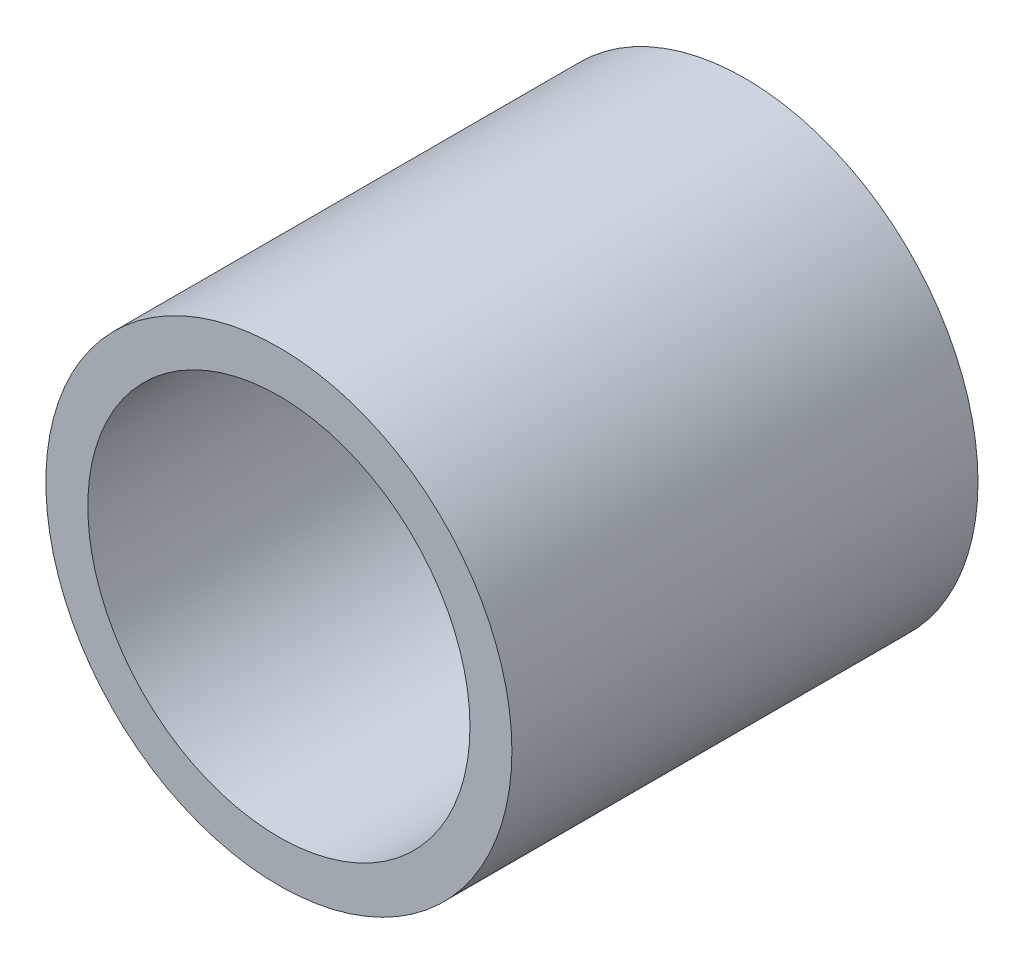
ISO-10303-21;
HEADER;
FILE_DESCRIPTION(('STEP AP214'),'2;1');
FILE_NAME('part.step','',(''),(''),'','','');
FILE_SCHEMA(('AUTOMOTIVE_DESIGN { 1 0 10303 214 1 1 1 1 }'));
ENDSEC;
DATA;
#1=APPLICATION_CONTEXT('core data for automotive mechanical design processes');
#2=APPLICATION_PROTOCOL_DEFINITION('international standard','automotive_design',2000,#1);
#3=PRODUCT_CONTEXT('',#1,'mechanical');
#4=PRODUCT('Part','Part','',(#3));
#5=PRODUCT_RELATED_PRODUCT_CATEGORY('part','',(#4));
#6=PRODUCT_DEFINITION_FORMATION('','',#4);
#7=PRODUCT_DEFINITION_CONTEXT('part definition',#1,'design');
#8=PRODUCT_DEFINITION('design','',#6,#7);
#9=PRODUCT_DEFINITION_SHAPE('','',#8);
#10=(LENGTH_UNIT() NAMED_UNIT(*) SI_UNIT(.MILLI.,.METRE.));
#11=(NAMED_UNIT(*) PLANE_ANGLE_UNIT() SI_UNIT($,.RADIAN.));
#12=(NAMED_UNIT(*) SI_UNIT($,.STERADIAN.) SOLID_ANGLE_UNIT());
#13=UNCERTAINTY_MEASURE_WITH_UNIT(LENGTH_MEASURE(1.E-05),#10,'distance_accuracy_value','');
#14=(GEOMETRIC_REPRESENTATION_CONTEXT(3) GLOBAL_UNCERTAINTY_ASSIGNED_CONTEXT((#13)) GLOBAL_UNIT_ASSIGNED_CONTEXT((#10,
#11,#12)) REPRESENTATION_CONTEXT('',''));
#15=CARTESIAN_POINT('',(0.,0.,0.));
#16=DIRECTION('',(0.,0.,1.));
#17=DIRECTION('',(1.,0.,0.));
#18=AXIS2_PLACEMENT_3D('',#15,#16,#17);
#19=CARTESIAN_POINT('',(0.,0.,10.));
#20=DIRECTION('',(0.,0.,1.));
#21=DIRECTION('',(1.,0.,0.));
#22=AXIS2_PLACEMENT_3D('',#19,#20,#21);
#23=CYLINDRICAL_SURFACE('',#22,4.1);
#24=CARTESIAN_POINT('',(0.,0.,10.));
#25=DIRECTION('',(0.,0.,1.));
#26=DIRECTION('',(1.,0.,0.));
#27=AXIS2_PLACEMENT_3D('',#24,#25,#26);
#28=CIRCLE('',#27,4.1);
#29=CARTESIAN_POINT('',(4.1,0.,10.));
#30=VERTEX_POINT('',#29);
#31=EDGE_CURVE('E28',#30,#30,#28,.F.);
#32=ORIENTED_EDGE('',*,*,#31,.F.);
#33=EDGE_LOOP('',(#32));
#34=FACE_BOUND('',#33,.T.);
#35=CARTESIAN_POINT('',(0.,0.,0.));
#36=DIRECTION('',(0.,0.,1.));
#37=DIRECTION('',(1.,0.,0.));
#38=AXIS2_PLACEMENT_3D('',#35,#36,#37);
#39=CIRCLE('',#38,4.1);
#40=CARTESIAN_POINT('',(4.1,0.,0.));
#41=VERTEX_POINT('',#40);
#42=EDGE_CURVE('E19',#41,#41,#39,.F.);
#43=ORIENTED_EDGE('',*,*,#42,.T.);
#44=EDGE_LOOP('',(#43));
#45=FACE_BOUND('',#44,.T.);
#46=ADVANCED_FACE('F16',(#34,#45),#23,.F.);
#47=CARTESIAN_POINT('',(0.,0.,0.));
#48=DIRECTION('',(0.,0.,1.));
#49=DIRECTION('',(1.,0.,0.));
#50=AXIS2_PLACEMENT_3D('',#47,#48,#49);
#51=PLANE('',#50);
#52=ORIENTED_EDGE('',*,*,#42,.F.);
#53=EDGE_LOOP('',(#52));
#54=FACE_BOUND('',#53,.T.);
#55=CARTESIAN_POINT('',(0.,0.,0.));
#56=DIRECTION('',(0.,0.,1.));
#57=DIRECTION('',(1.,0.,0.));
#58=AXIS2_PLACEMENT_3D('',#55,#56,#57);
#59=CIRCLE('',#58,5.);
#60=CARTESIAN_POINT('',(5.,0.,0.));
#61=VERTEX_POINT('',#60);
#62=EDGE_CURVE('E23',#61,#61,#59,.T.);
#63=ORIENTED_EDGE('',*,*,#62,.F.);
#64=EDGE_LOOP('',(#63));
#65=FACE_BOUND('',#64,.T.);
#66=ADVANCED_FACE('F37',(#54,#65),#51,.F.);
#67=CARTESIAN_POINT('',(0.,0.,10.));
#68=DIRECTION('',(0.,0.,1.));
#69=DIRECTION('',(1.,0.,0.));
#70=AXIS2_PLACEMENT_3D('',#67,#68,#69);
#71=PLANE('',#70);
#72=ORIENTED_EDGE('',*,*,#31,.T.);
#73=EDGE_LOOP('',(#72));
#74=FACE_BOUND('',#73,.T.);
#75=CARTESIAN_POINT('',(0.,0.,10.));
#76=DIRECTION('',(0.,0.,1.));
#77=DIRECTION('',(1.,0.,0.));
#78=AXIS2_PLACEMENT_3D('',#75,#76,#77);
#79=CIRCLE('',#78,5.);
#80=CARTESIAN_POINT('',(5.,0.,10.));
#81=VERTEX_POINT('',#80);
#82=EDGE_CURVE('E10',#81,#81,#79,.F.);
#83=ORIENTED_EDGE('',*,*,#82,.F.);
#84=EDGE_LOOP('',(#83));
#85=FACE_BOUND('',#84,.T.);
#86=ADVANCED_FACE('F40',(#74,#85),#71,.T.);
#87=CARTESIAN_POINT('',(0.,0.,10.));
#88=DIRECTION('',(0.,0.,1.));
#89=DIRECTION('',(1.,0.,0.));
#90=AXIS2_PLACEMENT_3D('',#87,#88,#89);
#91=CYLINDRICAL_SURFACE('',#90,5.);
#92=ORIENTED_EDGE('',*,*,#62,.T.);
#93=EDGE_LOOP('',(#92));
#94=FACE_BOUND('',#93,.T.);
#95=ORIENTED_EDGE('',*,*,#82,.T.);
#96=EDGE_LOOP('',(#95));
#97=FACE_BOUND('',#96,.T.);
#98=ADVANCED_FACE('F43',(#94,#97),#91,.T.);
#99=CLOSED_SHELL('',(#46,#66,#86,#98));
#100=MANIFOLD_SOLID_BREP('B1',#99);
#101=ADVANCED_BREP_SHAPE_REPRESENTATION('',(#18,#100),#14);
#102=SHAPE_DEFINITION_REPRESENTATION(#9,#101);
ENDSEC;
END-ISO-10303-21;
